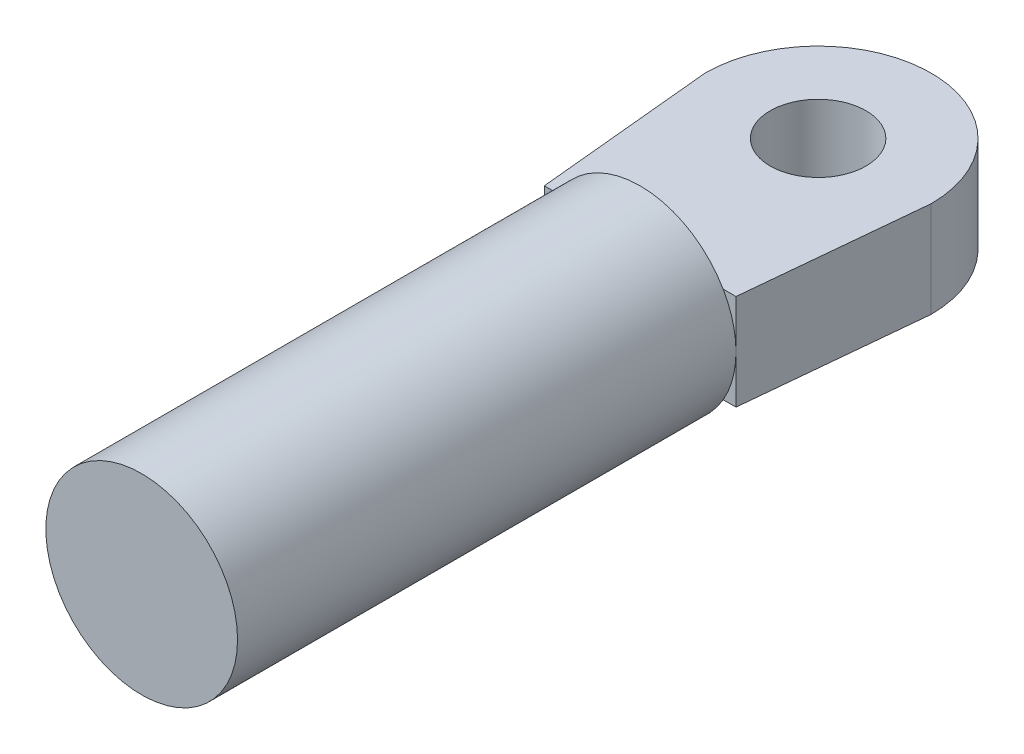
ISO-10303-21;
HEADER;
FILE_DESCRIPTION(('STEP AP214'),'2;1');
FILE_NAME('part.step','',(''),(''),'','','');
FILE_SCHEMA(('AUTOMOTIVE_DESIGN { 1 0 10303 214 1 1 1 1 }'));
ENDSEC;
DATA;
#1=APPLICATION_CONTEXT('core data for automotive mechanical design processes');
#2=APPLICATION_PROTOCOL_DEFINITION('international standard','automotive_design',2000,#1);
#3=PRODUCT_CONTEXT('',#1,'mechanical');
#4=PRODUCT('Part','Part','',(#3));
#5=PRODUCT_RELATED_PRODUCT_CATEGORY('part','',(#4));
#6=PRODUCT_DEFINITION_FORMATION('','',#4);
#7=PRODUCT_DEFINITION_CONTEXT('part definition',#1,'design');
#8=PRODUCT_DEFINITION('design','',#6,#7);
#9=PRODUCT_DEFINITION_SHAPE('','',#8);
#10=(LENGTH_UNIT() NAMED_UNIT(*) SI_UNIT(.MILLI.,.METRE.));
#11=(NAMED_UNIT(*) PLANE_ANGLE_UNIT() SI_UNIT($,.RADIAN.));
#12=(NAMED_UNIT(*) SI_UNIT($,.STERADIAN.) SOLID_ANGLE_UNIT());
#13=UNCERTAINTY_MEASURE_WITH_UNIT(LENGTH_MEASURE(1.E-05),#10,'distance_accuracy_value','');
#14=(GEOMETRIC_REPRESENTATION_CONTEXT(3) GLOBAL_UNCERTAINTY_ASSIGNED_CONTEXT((#13)) GLOBAL_UNIT_ASSIGNED_CONTEXT((#10,
#11,#12)) REPRESENTATION_CONTEXT('',''));
#15=CARTESIAN_POINT('',(0.,0.,0.));
#16=DIRECTION('',(0.,0.,1.));
#17=DIRECTION('',(1.,0.,0.));
#18=AXIS2_PLACEMENT_3D('',#15,#16,#17);
#19=CARTESIAN_POINT('',(0.,0.,0.));
#20=DIRECTION('',(0.,0.,1.));
#21=DIRECTION('',(1.,0.,0.));
#22=AXIS2_PLACEMENT_3D('',#19,#20,#21);
#23=PLANE('',#22);
#24=DIRECTION('',(1.,0.,0.));
#25=VECTOR('',#24,1.);
#26=CARTESIAN_POINT('',(0.,5.,0.));
#27=LINE('',#26,#25);
#28=CARTESIAN_POINT('',(-8.66025403784439,5.,0.));
#29=VERTEX_POINT('',#28);
#30=CARTESIAN_POINT('',(8.66025403784439,5.,0.));
#31=VERTEX_POINT('',#30);
#32=EDGE_CURVE('E11',#29,#31,#27,.T.);
#33=ORIENTED_EDGE('',*,*,#32,.F.);
#34=CARTESIAN_POINT('',(0.,0.,0.));
#35=DIRECTION('',(0.,0.,1.));
#36=DIRECTION('',(1.,0.,0.));
#37=AXIS2_PLACEMENT_3D('',#34,#35,#36);
#38=CIRCLE('',#37,10.);
#39=EDGE_CURVE('E154',#31,#29,#38,.T.);
#40=ORIENTED_EDGE('',*,*,#39,.F.);
#41=EDGE_LOOP('',(#33,#40));
#42=FACE_BOUND('',#41,.T.);
#43=ADVANCED_FACE('F37',(#42),#23,.F.);
#44=CARTESIAN_POINT('',(0.,0.,52.));
#45=DIRECTION('',(0.,0.,-1.));
#46=DIRECTION('',(-1.,0.,0.));
#47=AXIS2_PLACEMENT_3D('',#44,#45,#46);
#48=CYLINDRICAL_SURFACE('',#47,10.);
#49=CARTESIAN_POINT('',(0.,0.,52.));
#50=DIRECTION('',(0.,0.,1.));
#51=DIRECTION('',(1.,0.,0.));
#52=AXIS2_PLACEMENT_3D('',#49,#50,#51);
#53=CIRCLE('',#52,10.);
#54=CARTESIAN_POINT('',(10.,0.,52.));
#55=VERTEX_POINT('',#54);
#56=EDGE_CURVE('E149',#55,#55,#53,.T.);
#57=ORIENTED_EDGE('',*,*,#56,.F.);
#58=EDGE_LOOP('',(#57));
#59=FACE_BOUND('',#58,.T.);
#60=CARTESIAN_POINT('',(10.,0.,0.));
#61=VERTEX_POINT('',#60);
#62=EDGE_CURVE('E41',#61,#31,#38,.T.);
#63=ORIENTED_EDGE('',*,*,#62,.T.);
#64=ORIENTED_EDGE('',*,*,#39,.T.);
#65=CARTESIAN_POINT('',(-10.,0.,0.));
#66=VERTEX_POINT('',#65);
#67=EDGE_CURVE('E158',#29,#66,#38,.T.);
#68=ORIENTED_EDGE('',*,*,#67,.T.);
#69=CARTESIAN_POINT('',(-8.66025403784439,-5.,0.));
#70=VERTEX_POINT('',#69);
#71=EDGE_CURVE('E161',#66,#70,#38,.T.);
#72=ORIENTED_EDGE('',*,*,#71,.T.);
#73=CARTESIAN_POINT('',(8.66025403784439,-5.,0.));
#74=VERTEX_POINT('',#73);
#75=EDGE_CURVE('E159',#70,#74,#38,.T.);
#76=ORIENTED_EDGE('',*,*,#75,.T.);
#77=EDGE_CURVE('E143',#74,#61,#38,.T.);
#78=ORIENTED_EDGE('',*,*,#77,.T.);
#79=EDGE_LOOP('',(#63,#64,#68,#72,#76,#78));
#80=FACE_BOUND('',#79,.T.);
#81=ADVANCED_FACE('F39',(#59,#80),#48,.T.);
#82=CARTESIAN_POINT('',(0.,0.,52.));
#83=DIRECTION('',(0.,0.,1.));
#84=DIRECTION('',(1.,0.,0.));
#85=AXIS2_PLACEMENT_3D('',#82,#83,#84);
#86=PLANE('',#85);
#87=ORIENTED_EDGE('',*,*,#56,.T.);
#88=EDGE_LOOP('',(#87));
#89=FACE_BOUND('',#88,.T.);
#90=ADVANCED_FACE('F178',(#89),#86,.T.);
#91=ORIENTED_EDGE('',*,*,#75,.F.);
#92=DIRECTION('',(1.,0.,0.));
#93=VECTOR('',#92,1.);
#94=CARTESIAN_POINT('',(0.,-5.,0.));
#95=LINE('',#94,#93);
#96=EDGE_CURVE('E46',#70,#74,#95,.T.);
#97=ORIENTED_EDGE('',*,*,#96,.T.);
#98=EDGE_LOOP('',(#91,#97));
#99=FACE_BOUND('',#98,.T.);
#100=ADVANCED_FACE('F173',(#99),#23,.F.);
#101=CARTESIAN_POINT('',(0.,-5.,0.));
#102=DIRECTION('',(0.,0.,1.));
#103=DIRECTION('',(1.,0.,0.));
#104=AXIS2_PLACEMENT_3D('',#101,#102,#103);
#105=PLANE('',#104);
#106=ORIENTED_EDGE('',*,*,#67,.F.);
#107=CARTESIAN_POINT('',(-10.,5.,0.));
#108=VERTEX_POINT('',#107);
#109=EDGE_CURVE('E48',#108,#29,#27,.T.);
#110=ORIENTED_EDGE('',*,*,#109,.F.);
#111=DIRECTION('',(0.,1.,0.));
#112=VECTOR('',#111,1.);
#113=CARTESIAN_POINT('',(-10.,-5.,0.));
#114=LINE('',#113,#112);
#115=EDGE_CURVE('E148',#66,#108,#114,.T.);
#116=ORIENTED_EDGE('',*,*,#115,.F.);
#117=EDGE_LOOP('',(#106,#110,#116));
#118=FACE_BOUND('',#117,.T.);
#119=ADVANCED_FACE('F169',(#118),#105,.T.);
#120=ORIENTED_EDGE('',*,*,#71,.F.);
#121=CARTESIAN_POINT('',(-10.,-5.,0.));
#122=VERTEX_POINT('',#121);
#123=EDGE_CURVE('E145',#122,#66,#114,.T.);
#124=ORIENTED_EDGE('',*,*,#123,.F.);
#125=EDGE_CURVE('E111',#122,#70,#95,.T.);
#126=ORIENTED_EDGE('',*,*,#125,.T.);
#127=EDGE_LOOP('',(#120,#124,#126));
#128=FACE_BOUND('',#127,.T.);
#129=ADVANCED_FACE('F187',(#128),#105,.T.);
#130=ORIENTED_EDGE('',*,*,#62,.F.);
#131=DIRECTION('',(0.,1.,0.));
#132=VECTOR('',#131,1.);
#133=CARTESIAN_POINT('',(10.,-5.,0.));
#134=LINE('',#133,#132);
#135=CARTESIAN_POINT('',(10.,5.,0.));
#136=VERTEX_POINT('',#135);
#137=EDGE_CURVE('E144',#61,#136,#134,.T.);
#138=ORIENTED_EDGE('',*,*,#137,.T.);
#139=EDGE_CURVE('E49',#31,#136,#27,.T.);
#140=ORIENTED_EDGE('',*,*,#139,.F.);
#141=EDGE_LOOP('',(#130,#138,#140));
#142=FACE_BOUND('',#141,.T.);
#143=ADVANCED_FACE('F242',(#142),#105,.T.);
#144=ORIENTED_EDGE('',*,*,#77,.F.);
#145=CARTESIAN_POINT('',(10.,-5.,0.));
#146=VERTEX_POINT('',#145);
#147=EDGE_CURVE('E56',#74,#146,#95,.T.);
#148=ORIENTED_EDGE('',*,*,#147,.T.);
#149=EDGE_CURVE('E140',#146,#61,#134,.T.);
#150=ORIENTED_EDGE('',*,*,#149,.T.);
#151=EDGE_LOOP('',(#144,#148,#150));
#152=FACE_BOUND('',#151,.T.);
#153=ADVANCED_FACE('F189',(#152),#105,.T.);
#154=CARTESIAN_POINT('',(9.90706173446323,-5.,0.959554654080061));
#155=DIRECTION('',(0.995342239356053,0.,0.0964044944682399));
#156=DIRECTION('',(0.0964044944682399,0.,-0.995342239356053));
#157=AXIS2_PLACEMENT_3D('',#154,#155,#156);
#158=PLANE('',#157);
#159=DIRECTION('',(0.,1.,0.));
#160=VECTOR('',#159,1.);
#161=CARTESIAN_POINT('',(11.7982745070005,-5.,-18.5665469711522));
#162=LINE('',#161,#160);
#163=CARTESIAN_POINT('',(11.7982745070005,-5.,-18.5665469711522));
#164=VERTEX_POINT('',#163);
#165=CARTESIAN_POINT('',(11.7982745070005,5.,-18.5665469711522));
#166=VERTEX_POINT('',#165);
#167=EDGE_CURVE('E99',#164,#166,#162,.T.);
#168=ORIENTED_EDGE('',*,*,#167,.T.);
#169=DIRECTION('',(0.0964044944682399,0.,-0.995342239356053));
#170=VECTOR('',#169,1.);
#171=CARTESIAN_POINT('',(9.90706173446323,5.,0.959554654080061));
#172=LINE('',#171,#170);
#173=EDGE_CURVE('E104',#136,#166,#172,.T.);
#174=ORIENTED_EDGE('',*,*,#173,.F.);
#175=ORIENTED_EDGE('',*,*,#137,.F.);
#176=ORIENTED_EDGE('',*,*,#149,.F.);
#177=DIRECTION('',(0.0964044944682399,0.,-0.995342239356053));
#178=VECTOR('',#177,1.);
#179=CARTESIAN_POINT('',(9.90706173446323,-5.,0.959554654080061));
#180=LINE('',#179,#178);
#181=EDGE_CURVE('E106',#146,#164,#180,.T.);
#182=ORIENTED_EDGE('',*,*,#181,.T.);
#183=EDGE_LOOP('',(#168,#174,#175,#176,#182));
#184=FACE_BOUND('',#183,.T.);
#185=ADVANCED_FACE('F101',(#184),#158,.T.);
#186=CARTESIAN_POINT('',(-9.90706173446323,-5.,0.959554654080061));
#187=DIRECTION('',(-0.995342239356053,0.,0.0964044944682399));
#188=DIRECTION('',(0.0964044944682399,0.,0.995342239356053));
#189=AXIS2_PLACEMENT_3D('',#186,#187,#188);
#190=PLANE('',#189);
#191=ORIENTED_EDGE('',*,*,#123,.T.);
#192=ORIENTED_EDGE('',*,*,#115,.T.);
#193=DIRECTION('',(0.0964044944682399,0.,0.995342239356053));
#194=VECTOR('',#193,1.);
#195=CARTESIAN_POINT('',(-9.90706173446323,5.,0.959554654080061));
#196=LINE('',#195,#194);
#197=CARTESIAN_POINT('',(-11.7982745070005,5.,-18.5665469711522));
#198=VERTEX_POINT('',#197);
#199=EDGE_CURVE('E119',#198,#108,#196,.T.);
#200=ORIENTED_EDGE('',*,*,#199,.F.);
#201=DIRECTION('',(0.,1.,0.));
#202=VECTOR('',#201,1.);
#203=CARTESIAN_POINT('',(-11.7982745070005,-5.,-18.5665469711522));
#204=LINE('',#203,#202);
#205=CARTESIAN_POINT('',(-11.7982745070005,-5.,-18.5665469711522));
#206=VERTEX_POINT('',#205);
#207=EDGE_CURVE('E110',#206,#198,#204,.T.);
#208=ORIENTED_EDGE('',*,*,#207,.F.);
#209=DIRECTION('',(0.0964044944682399,0.,0.995342239356053));
#210=VECTOR('',#209,1.);
#211=CARTESIAN_POINT('',(-9.90706173446323,-5.,0.959554654080061));
#212=LINE('',#211,#210);
#213=EDGE_CURVE('E136',#206,#122,#212,.T.);
#214=ORIENTED_EDGE('',*,*,#213,.T.);
#215=EDGE_LOOP('',(#191,#192,#200,#208,#214));
#216=FACE_BOUND('',#215,.T.);
#217=ADVANCED_FACE('F197',(#216),#190,.T.);
#218=CARTESIAN_POINT('',(0.,-5.,-18.5665469711522));
#219=DIRECTION('',(0.,1.,0.));
#220=DIRECTION('',(0.,0.,1.));
#221=AXIS2_PLACEMENT_3D('',#218,#219,#220);
#222=CYLINDRICAL_SURFACE('',#221,5.);
#223=CARTESIAN_POINT('',(0.,-5.,-18.5665469711522));
#224=DIRECTION('',(0.,1.,0.));
#225=DIRECTION('',(0.,0.,1.));
#226=AXIS2_PLACEMENT_3D('',#223,#224,#225);
#227=CIRCLE('',#226,5.);
#228=CARTESIAN_POINT('',(0.,-5.,-13.5665469711522));
#229=VERTEX_POINT('',#228);
#230=EDGE_CURVE('E130',#229,#229,#227,.T.);
#231=ORIENTED_EDGE('',*,*,#230,.F.);
#232=EDGE_LOOP('',(#231));
#233=FACE_BOUND('',#232,.T.);
#234=CARTESIAN_POINT('',(0.,5.,-18.5665469711522));
#235=DIRECTION('',(0.,1.,0.));
#236=DIRECTION('',(0.,0.,1.));
#237=AXIS2_PLACEMENT_3D('',#234,#235,#236);
#238=CIRCLE('',#237,5.);
#239=CARTESIAN_POINT('',(0.,5.,-13.5665469711522));
#240=VERTEX_POINT('',#239);
#241=EDGE_CURVE('E123',#240,#240,#238,.T.);
#242=ORIENTED_EDGE('',*,*,#241,.T.);
#243=EDGE_LOOP('',(#242));
#244=FACE_BOUND('',#243,.T.);
#245=ADVANCED_FACE('F194',(#233,#244),#222,.F.);
#246=CARTESIAN_POINT('',(0.,-5.,-18.5665469711522));
#247=DIRECTION('',(0.,1.,0.));
#248=DIRECTION('',(0.,0.,1.));
#249=AXIS2_PLACEMENT_3D('',#246,#247,#248);
#250=CYLINDRICAL_SURFACE('',#249,11.7982745070005);
#251=ORIENTED_EDGE('',*,*,#207,.T.);
#252=CARTESIAN_POINT('',(0.,5.,-18.5665469711522));
#253=DIRECTION('',(0.,1.,0.));
#254=DIRECTION('',(0.,0.,1.));
#255=AXIS2_PLACEMENT_3D('',#252,#253,#254);
#256=CIRCLE('',#255,11.7982745070005);
#257=EDGE_CURVE('E114',#166,#198,#256,.T.);
#258=ORIENTED_EDGE('',*,*,#257,.F.);
#259=ORIENTED_EDGE('',*,*,#167,.F.);
#260=CARTESIAN_POINT('',(0.,-5.,-18.5665469711522));
#261=DIRECTION('',(0.,1.,0.));
#262=DIRECTION('',(0.,0.,1.));
#263=AXIS2_PLACEMENT_3D('',#260,#261,#262);
#264=CIRCLE('',#263,11.7982745070005);
#265=EDGE_CURVE('E134',#164,#206,#264,.T.);
#266=ORIENTED_EDGE('',*,*,#265,.T.);
#267=EDGE_LOOP('',(#251,#258,#259,#266));
#268=FACE_BOUND('',#267,.T.);
#269=ADVANCED_FACE('F115',(#268),#250,.T.);
#270=CARTESIAN_POINT('',(0.,-5.,0.));
#271=DIRECTION('',(0.,1.,0.));
#272=DIRECTION('',(0.,0.,1.));
#273=AXIS2_PLACEMENT_3D('',#270,#271,#272);
#274=PLANE('',#273);
#275=ORIENTED_EDGE('',*,*,#230,.T.);
#276=EDGE_LOOP('',(#275));
#277=FACE_BOUND('',#276,.T.);
#278=ORIENTED_EDGE('',*,*,#181,.F.);
#279=ORIENTED_EDGE('',*,*,#147,.F.);
#280=ORIENTED_EDGE('',*,*,#96,.F.);
#281=ORIENTED_EDGE('',*,*,#125,.F.);
#282=ORIENTED_EDGE('',*,*,#213,.F.);
#283=ORIENTED_EDGE('',*,*,#265,.F.);
#284=EDGE_LOOP('',(#278,#279,#280,#281,#282,#283));
#285=FACE_BOUND('',#284,.T.);
#286=ADVANCED_FACE('F203',(#277,#285),#274,.F.);
#287=CARTESIAN_POINT('',(0.,5.,0.));
#288=DIRECTION('',(0.,1.,0.));
#289=DIRECTION('',(0.,0.,1.));
#290=AXIS2_PLACEMENT_3D('',#287,#288,#289);
#291=PLANE('',#290);
#292=ORIENTED_EDGE('',*,*,#241,.F.);
#293=EDGE_LOOP('',(#292));
#294=FACE_BOUND('',#293,.T.);
#295=ORIENTED_EDGE('',*,*,#173,.T.);
#296=ORIENTED_EDGE('',*,*,#257,.T.);
#297=ORIENTED_EDGE('',*,*,#199,.T.);
#298=ORIENTED_EDGE('',*,*,#109,.T.);
#299=ORIENTED_EDGE('',*,*,#32,.T.);
#300=ORIENTED_EDGE('',*,*,#139,.T.);
#301=EDGE_LOOP('',(#295,#296,#297,#298,#299,#300));
#302=FACE_BOUND('',#301,.T.);
#303=ADVANCED_FACE('F121',(#294,#302),#291,.T.);
#304=CLOSED_SHELL('',(#43,#81,#90,#100,#119,#129,#143,#153,#185,#217,#245,#269,#286,#303));
#305=MANIFOLD_SOLID_BREP('B2',#304);
#306=ADVANCED_BREP_SHAPE_REPRESENTATION('',(#18,#305),#14);
#307=SHAPE_DEFINITION_REPRESENTATION(#9,#306);
ENDSEC;
END-ISO-10303-21;
